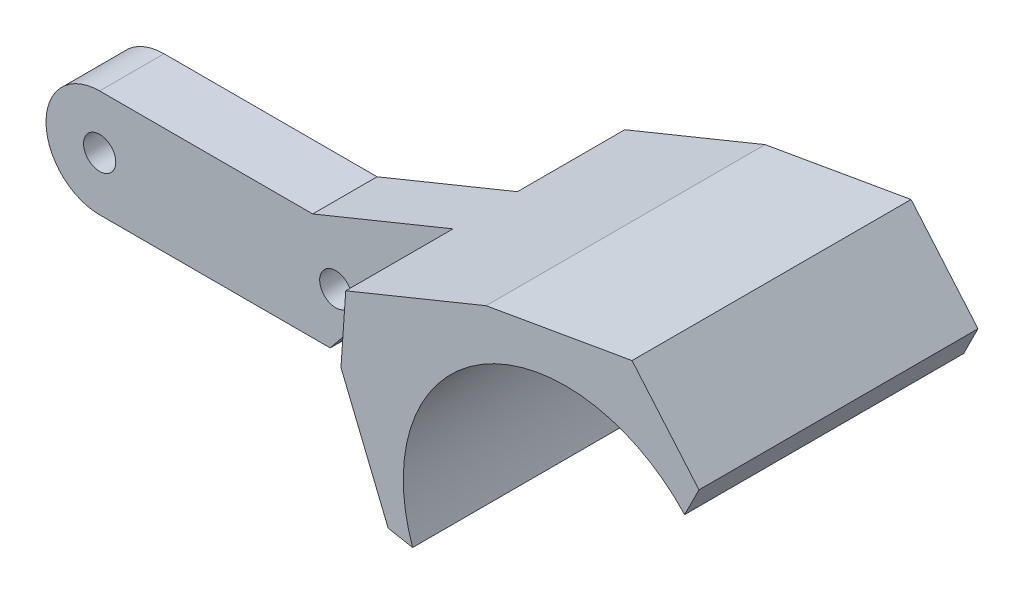
ISO-10303-21;
HEADER;
FILE_DESCRIPTION(('STEP AP214'),'2;1');
FILE_NAME('part.step','',(''),(''),'','','');
FILE_SCHEMA(('AUTOMOTIVE_DESIGN { 1 0 10303 214 1 1 1 1 }'));
ENDSEC;
DATA;
#1=APPLICATION_CONTEXT('core data for automotive mechanical design processes');
#2=APPLICATION_PROTOCOL_DEFINITION('international standard','automotive_design',2000,#1);
#3=PRODUCT_CONTEXT('',#1,'mechanical');
#4=PRODUCT('Part','Part','',(#3));
#5=PRODUCT_RELATED_PRODUCT_CATEGORY('part','',(#4));
#6=PRODUCT_DEFINITION_FORMATION('','',#4);
#7=PRODUCT_DEFINITION_CONTEXT('part definition',#1,'design');
#8=PRODUCT_DEFINITION('design','',#6,#7);
#9=PRODUCT_DEFINITION_SHAPE('','',#8);
#10=(LENGTH_UNIT() NAMED_UNIT(*) SI_UNIT(.MILLI.,.METRE.));
#11=(NAMED_UNIT(*) PLANE_ANGLE_UNIT() SI_UNIT($,.RADIAN.));
#12=(NAMED_UNIT(*) SI_UNIT($,.STERADIAN.) SOLID_ANGLE_UNIT());
#13=UNCERTAINTY_MEASURE_WITH_UNIT(LENGTH_MEASURE(1.E-05),#10,'distance_accuracy_value','');
#14=(GEOMETRIC_REPRESENTATION_CONTEXT(3) GLOBAL_UNCERTAINTY_ASSIGNED_CONTEXT((#13)) GLOBAL_UNIT_ASSIGNED_CONTEXT((#10,
#11,#12)) REPRESENTATION_CONTEXT('',''));
#15=CARTESIAN_POINT('',(0.,0.,0.));
#16=DIRECTION('',(0.,0.,1.));
#17=DIRECTION('',(1.,0.,0.));
#18=AXIS2_PLACEMENT_3D('',#15,#16,#17);
#19=CARTESIAN_POINT('',(-13.5877693584169,0.,9.));
#20=DIRECTION('',(0.,0.,1.));
#21=DIRECTION('',(1.,0.,0.));
#22=AXIS2_PLACEMENT_3D('',#19,#20,#21);
#23=PLANE('',#22);
#24=DIRECTION('',(-0.0692999394417523,-0.997595869274412,0.));
#25=VECTOR('',#24,1.);
#26=CARTESIAN_POINT('',(18.4699286145007,-2.22695040806557,9.));
#27=LINE('',#26,#25);
#28=CARTESIAN_POINT('',(19.3426661423996,10.3363989946344,9.));
#29=VERTEX_POINT('',#28);
#30=CARTESIAN_POINT('',(18.8975900089992,3.92937878986169,9.));
#31=VERTEX_POINT('',#30);
#32=EDGE_CURVE('E58',#29,#31,#27,.T.);
#33=ORIENTED_EDGE('',*,*,#32,.F.);
#34=DIRECTION('',(-0.925886158033167,-0.377802623551745,0.));
#35=VECTOR('',#34,1.);
#36=CARTESIAN_POINT('',(6.26467870963807,5.,9.));
#37=LINE('',#36,#35);
#38=CARTESIAN_POINT('',(6.26467870963807,5.,9.));
#39=VERTEX_POINT('',#38);
#40=EDGE_CURVE('E128',#29,#39,#37,.T.);
#41=ORIENTED_EDGE('',*,*,#40,.T.);
#42=DIRECTION('',(-1.,0.,0.));
#43=VECTOR('',#42,1.);
#44=CARTESIAN_POINT('',(-13.5877693584169,5.,9.));
#45=LINE('',#44,#43);
#46=CARTESIAN_POINT('',(-13.5877693584169,5.,9.));
#47=VERTEX_POINT('',#46);
#48=EDGE_CURVE('E65',#39,#47,#45,.T.);
#49=ORIENTED_EDGE('',*,*,#48,.T.);
#50=CARTESIAN_POINT('',(-13.5877693584169,0.,9.));
#51=DIRECTION('',(0.,0.,1.));
#52=DIRECTION('',(1.,0.,0.));
#53=AXIS2_PLACEMENT_3D('',#50,#51,#52);
#54=CIRCLE('',#53,5.);
#55=CARTESIAN_POINT('',(-13.5877693584169,-5.,9.));
#56=VERTEX_POINT('',#55);
#57=EDGE_CURVE('E147',#47,#56,#54,.T.);
#58=ORIENTED_EDGE('',*,*,#57,.T.);
#59=DIRECTION('',(1.,0.,0.));
#60=VECTOR('',#59,1.);
#61=CARTESIAN_POINT('',(-13.5877693584169,-5.,9.));
#62=LINE('',#61,#60);
#63=CARTESIAN_POINT('',(7.89764564460259,-5.,9.));
#64=VERTEX_POINT('',#63);
#65=EDGE_CURVE('E100',#56,#64,#62,.T.);
#66=ORIENTED_EDGE('',*,*,#65,.T.);
#67=DIRECTION('',(0.624567450076719,0.780970870330427,0.));
#68=VECTOR('',#67,1.);
#69=CARTESIAN_POINT('',(7.89764564460259,-5.,9.));
#70=LINE('',#69,#68);
#71=CARTESIAN_POINT('',(13.1673407024615,1.58932567684477,9.));
#72=VERTEX_POINT('',#71);
#73=EDGE_CURVE('E106',#64,#72,#70,.T.);
#74=ORIENTED_EDGE('',*,*,#73,.T.);
#75=DIRECTION('',(0.925781163628902,0.378059832658689,0.));
#76=VECTOR('',#75,1.);
#77=CARTESIAN_POINT('',(13.1673407024615,1.58932567684477,9.));
#78=LINE('',#77,#76);
#79=EDGE_CURVE('E111',#72,#31,#78,.T.);
#80=ORIENTED_EDGE('',*,*,#79,.T.);
#81=EDGE_LOOP('',(#33,#41,#49,#58,#66,#74,#80));
#82=FACE_BOUND('',#81,.T.);
#83=CARTESIAN_POINT('',(-13.5877693584169,0.,9.));
#84=DIRECTION('',(0.,0.,1.));
#85=DIRECTION('',(1.,0.,0.));
#86=AXIS2_PLACEMENT_3D('',#83,#84,#85);
#87=CIRCLE('',#86,1.5);
#88=CARTESIAN_POINT('',(-12.0877693584169,0.,9.));
#89=VERTEX_POINT('',#88);
#90=EDGE_CURVE('E139',#89,#89,#87,.T.);
#91=ORIENTED_EDGE('',*,*,#90,.F.);
#92=EDGE_LOOP('',(#91));
#93=FACE_BOUND('',#92,.T.);
#94=CARTESIAN_POINT('',(8.41223064158309,0.,9.));
#95=DIRECTION('',(0.,0.,1.));
#96=DIRECTION('',(1.,0.,0.));
#97=AXIS2_PLACEMENT_3D('',#94,#95,#96);
#98=CIRCLE('',#97,1.5);
#99=CARTESIAN_POINT('',(9.91223064158309,0.,9.));
#100=VERTEX_POINT('',#99);
#101=EDGE_CURVE('E208',#100,#100,#98,.T.);
#102=ORIENTED_EDGE('',*,*,#101,.F.);
#103=EDGE_LOOP('',(#102));
#104=FACE_BOUND('',#103,.T.);
#105=ADVANCED_FACE('F43',(#82,#93,#104),#23,.T.);
#106=CARTESIAN_POINT('',(-13.5877693584169,0.,3.));
#107=DIRECTION('',(0.,0.,1.));
#108=DIRECTION('',(1.,0.,0.));
#109=AXIS2_PLACEMENT_3D('',#106,#107,#108);
#110=PLANE('',#109);
#111=DIRECTION('',(-0.925886158033167,-0.377802623551745,0.));
#112=VECTOR('',#111,1.);
#113=CARTESIAN_POINT('',(6.26467870963807,5.,3.));
#114=LINE('',#113,#112);
#115=CARTESIAN_POINT('',(19.3426661423996,10.3363989946344,3.));
#116=VERTEX_POINT('',#115);
#117=CARTESIAN_POINT('',(6.26467870963807,5.,3.));
#118=VERTEX_POINT('',#117);
#119=EDGE_CURVE('E144',#116,#118,#114,.T.);
#120=ORIENTED_EDGE('',*,*,#119,.F.);
#121=DIRECTION('',(-0.0692999394417523,-0.997595869274412,0.));
#122=VECTOR('',#121,1.);
#123=CARTESIAN_POINT('',(18.4699286145007,-2.22695040806557,3.));
#124=LINE('',#123,#122);
#125=CARTESIAN_POINT('',(18.8975900089992,3.92937878986169,3.));
#126=VERTEX_POINT('',#125);
#127=EDGE_CURVE('E176',#116,#126,#124,.T.);
#128=ORIENTED_EDGE('',*,*,#127,.T.);
#129=DIRECTION('',(0.925781163628902,0.378059832658689,0.));
#130=VECTOR('',#129,1.);
#131=CARTESIAN_POINT('',(13.1673407024615,1.58932567684477,3.));
#132=LINE('',#131,#130);
#133=CARTESIAN_POINT('',(13.1673407024615,1.58932567684477,3.));
#134=VERTEX_POINT('',#133);
#135=EDGE_CURVE('E142',#134,#126,#132,.T.);
#136=ORIENTED_EDGE('',*,*,#135,.F.);
#137=DIRECTION('',(0.624567450076719,0.780970870330427,0.));
#138=VECTOR('',#137,1.);
#139=CARTESIAN_POINT('',(7.89764564460259,-5.,3.));
#140=LINE('',#139,#138);
#141=CARTESIAN_POINT('',(7.89764564460259,-5.,3.));
#142=VERTEX_POINT('',#141);
#143=EDGE_CURVE('E119',#142,#134,#140,.T.);
#144=ORIENTED_EDGE('',*,*,#143,.F.);
#145=DIRECTION('',(1.,0.,0.));
#146=VECTOR('',#145,1.);
#147=CARTESIAN_POINT('',(-13.5877693584169,-5.,3.));
#148=LINE('',#147,#146);
#149=CARTESIAN_POINT('',(-13.5877693584169,-5.,3.));
#150=VERTEX_POINT('',#149);
#151=EDGE_CURVE('E138',#150,#142,#148,.T.);
#152=ORIENTED_EDGE('',*,*,#151,.F.);
#153=CARTESIAN_POINT('',(-13.5877693584169,0.,3.));
#154=DIRECTION('',(0.,0.,1.));
#155=DIRECTION('',(1.,0.,0.));
#156=AXIS2_PLACEMENT_3D('',#153,#154,#155);
#157=CIRCLE('',#156,5.);
#158=CARTESIAN_POINT('',(-13.5877693584169,5.,3.));
#159=VERTEX_POINT('',#158);
#160=EDGE_CURVE('E135',#159,#150,#157,.T.);
#161=ORIENTED_EDGE('',*,*,#160,.F.);
#162=DIRECTION('',(-1.,0.,0.));
#163=VECTOR('',#162,1.);
#164=CARTESIAN_POINT('',(-13.5877693584169,5.,3.));
#165=LINE('',#164,#163);
#166=EDGE_CURVE('E92',#118,#159,#165,.T.);
#167=ORIENTED_EDGE('',*,*,#166,.F.);
#168=EDGE_LOOP('',(#120,#128,#136,#144,#152,#161,#167));
#169=FACE_BOUND('',#168,.T.);
#170=CARTESIAN_POINT('',(-13.5877693584169,0.,3.));
#171=DIRECTION('',(0.,0.,1.));
#172=DIRECTION('',(1.,0.,0.));
#173=AXIS2_PLACEMENT_3D('',#170,#171,#172);
#174=CIRCLE('',#173,1.5);
#175=CARTESIAN_POINT('',(-12.0877693584169,0.,3.));
#176=VERTEX_POINT('',#175);
#177=EDGE_CURVE('E211',#176,#176,#174,.T.);
#178=ORIENTED_EDGE('',*,*,#177,.T.);
#179=EDGE_LOOP('',(#178));
#180=FACE_BOUND('',#179,.T.);
#181=CARTESIAN_POINT('',(8.41223064158309,0.,3.));
#182=DIRECTION('',(0.,0.,1.));
#183=DIRECTION('',(1.,0.,0.));
#184=AXIS2_PLACEMENT_3D('',#181,#182,#183);
#185=CIRCLE('',#184,1.5);
#186=CARTESIAN_POINT('',(9.91223064158309,0.,3.));
#187=VERTEX_POINT('',#186);
#188=EDGE_CURVE('E207',#187,#187,#185,.T.);
#189=ORIENTED_EDGE('',*,*,#188,.T.);
#190=EDGE_LOOP('',(#189));
#191=FACE_BOUND('',#190,.T.);
#192=ADVANCED_FACE('F171',(#169,#180,#191),#110,.F.);
#193=CARTESIAN_POINT('',(-13.5877693584169,0.,9.));
#194=DIRECTION('',(0.,0.,-1.));
#195=DIRECTION('',(-1.,0.,0.));
#196=AXIS2_PLACEMENT_3D('',#193,#194,#195);
#197=CYLINDRICAL_SURFACE('',#196,5.);
#198=ORIENTED_EDGE('',*,*,#160,.T.);
#199=DIRECTION('',(0.,0.,-1.));
#200=VECTOR('',#199,1.);
#201=CARTESIAN_POINT('',(-13.5877693584169,-5.,9.));
#202=LINE('',#201,#200);
#203=EDGE_CURVE('E11',#56,#150,#202,.T.);
#204=ORIENTED_EDGE('',*,*,#203,.F.);
#205=ORIENTED_EDGE('',*,*,#57,.F.);
#206=DIRECTION('',(0.,0.,-1.));
#207=VECTOR('',#206,1.);
#208=CARTESIAN_POINT('',(-13.5877693584169,5.,9.));
#209=LINE('',#208,#207);
#210=EDGE_CURVE('E134',#47,#159,#209,.T.);
#211=ORIENTED_EDGE('',*,*,#210,.T.);
#212=EDGE_LOOP('',(#198,#204,#205,#211));
#213=FACE_BOUND('',#212,.T.);
#214=ADVANCED_FACE('F45',(#213),#197,.T.);
#215=CARTESIAN_POINT('',(-13.5877693584169,-5.,9.));
#216=DIRECTION('',(0.,1.,0.));
#217=DIRECTION('',(-1.,0.,0.));
#218=AXIS2_PLACEMENT_3D('',#215,#216,#217);
#219=PLANE('',#218);
#220=ORIENTED_EDGE('',*,*,#151,.T.);
#221=DIRECTION('',(0.,0.,-1.));
#222=VECTOR('',#221,1.);
#223=CARTESIAN_POINT('',(7.89764564460259,-5.,9.));
#224=LINE('',#223,#222);
#225=EDGE_CURVE('E51',#64,#142,#224,.T.);
#226=ORIENTED_EDGE('',*,*,#225,.F.);
#227=ORIENTED_EDGE('',*,*,#65,.F.);
#228=ORIENTED_EDGE('',*,*,#203,.T.);
#229=EDGE_LOOP('',(#220,#226,#227,#228));
#230=FACE_BOUND('',#229,.T.);
#231=ADVANCED_FACE('F221',(#230),#219,.F.);
#232=CARTESIAN_POINT('',(7.89764564460259,-5.,9.));
#233=DIRECTION('',(-0.780970870330427,0.624567450076719,0.));
#234=DIRECTION('',(-0.624567450076719,-0.780970870330428,0.));
#235=AXIS2_PLACEMENT_3D('',#232,#233,#234);
#236=PLANE('',#235);
#237=ORIENTED_EDGE('',*,*,#143,.T.);
#238=DIRECTION('',(0.,0.,-1.));
#239=VECTOR('',#238,1.);
#240=CARTESIAN_POINT('',(13.1673407024615,1.58932567684477,9.));
#241=LINE('',#240,#239);
#242=EDGE_CURVE('E116',#72,#134,#241,.T.);
#243=ORIENTED_EDGE('',*,*,#242,.F.);
#244=ORIENTED_EDGE('',*,*,#73,.F.);
#245=ORIENTED_EDGE('',*,*,#225,.T.);
#246=EDGE_LOOP('',(#237,#243,#244,#245));
#247=FACE_BOUND('',#246,.T.);
#248=ADVANCED_FACE('F117',(#247),#236,.F.);
#249=CARTESIAN_POINT('',(13.1673407024615,1.58932567684477,9.));
#250=DIRECTION('',(-0.378059832658689,0.925781163628902,0.));
#251=DIRECTION('',(-0.925781163628902,-0.378059832658689,0.));
#252=AXIS2_PLACEMENT_3D('',#249,#250,#251);
#253=PLANE('',#252);
#254=ORIENTED_EDGE('',*,*,#135,.T.);
#255=DIRECTION('',(0.,0.,-1.));
#256=VECTOR('',#255,1.);
#257=CARTESIAN_POINT('',(18.8975900089992,3.92937878986169,9.));
#258=LINE('',#257,#256);
#259=EDGE_CURVE('E123',#31,#126,#258,.T.);
#260=ORIENTED_EDGE('',*,*,#259,.F.);
#261=ORIENTED_EDGE('',*,*,#79,.F.);
#262=ORIENTED_EDGE('',*,*,#242,.T.);
#263=EDGE_LOOP('',(#254,#260,#261,#262));
#264=FACE_BOUND('',#263,.T.);
#265=ADVANCED_FACE('F126',(#264),#253,.F.);
#266=CARTESIAN_POINT('',(23.2965282034834,-6.84260428960336,9.));
#267=DIRECTION('',(0.925781163629019,0.378059832658403,0.));
#268=DIRECTION('',(-0.378059832658403,0.925781163629019,0.));
#269=AXIS2_PLACEMENT_3D('',#266,#267,#268);
#270=PLANE('',#269);
#271=ORIENTED_EDGE('',*,*,#259,.T.);
#272=DIRECTION('',(0.,0.,1.));
#273=VECTOR('',#272,1.);
#274=CARTESIAN_POINT('',(18.8975900089992,3.92937878986169,-7.));
#275=LINE('',#274,#273);
#276=CARTESIAN_POINT('',(18.8975900089992,3.92937878986169,-7.));
#277=VERTEX_POINT('',#276);
#278=EDGE_CURVE('E183',#277,#126,#275,.T.);
#279=ORIENTED_EDGE('',*,*,#278,.F.);
#280=DIRECTION('',(0.378059832658403,-0.925781163629019,0.));
#281=VECTOR('',#280,1.);
#282=CARTESIAN_POINT('',(18.8975900089992,3.92937878986169,-7.));
#283=LINE('',#282,#281);
#284=CARTESIAN_POINT('',(23.2965282034834,-6.84260428960336,-7.));
#285=VERTEX_POINT('',#284);
#286=EDGE_CURVE('E458',#277,#285,#283,.T.);
#287=ORIENTED_EDGE('',*,*,#286,.T.);
#288=DIRECTION('',(0.,0.,-1.));
#289=VECTOR('',#288,1.);
#290=CARTESIAN_POINT('',(23.2965282034834,-6.84260428960336,9.));
#291=LINE('',#290,#289);
#292=CARTESIAN_POINT('',(23.2965282034834,-6.84260428960336,19.));
#293=VERTEX_POINT('',#292);
#294=EDGE_CURVE('E166',#293,#285,#291,.T.);
#295=ORIENTED_EDGE('',*,*,#294,.F.);
#296=DIRECTION('',(0.378059832658403,-0.925781163629019,0.));
#297=VECTOR('',#296,1.);
#298=CARTESIAN_POINT('',(18.8975900089992,3.92937878986169,19.));
#299=LINE('',#298,#297);
#300=CARTESIAN_POINT('',(18.8975900089992,3.92937878986169,19.));
#301=VERTEX_POINT('',#300);
#302=EDGE_CURVE('E191',#301,#293,#299,.T.);
#303=ORIENTED_EDGE('',*,*,#302,.F.);
#304=EDGE_CURVE('E187',#31,#301,#275,.T.);
#305=ORIENTED_EDGE('',*,*,#304,.F.);
#306=EDGE_LOOP('',(#271,#279,#287,#295,#303,#305));
#307=FACE_BOUND('',#306,.T.);
#308=ADVANCED_FACE('F180',(#307),#270,.F.);
#309=CARTESIAN_POINT('',(23.2965282034834,-6.84260428960336,9.));
#310=DIRECTION('',(0.182403137016179,0.983223827826938,0.));
#311=DIRECTION('',(-0.983223827826939,0.182403137016179,0.));
#312=AXIS2_PLACEMENT_3D('',#309,#310,#311);
#313=PLANE('',#312);
#314=ORIENTED_EDGE('',*,*,#294,.T.);
#315=DIRECTION('',(0.983223827826933,-0.182403137016207,0.));
#316=VECTOR('',#315,1.);
#317=CARTESIAN_POINT('',(23.2965282034834,-6.84260428960336,-7.));
#318=LINE('',#317,#316);
#319=CARTESIAN_POINT('',(25.5770058268283,-7.26566795081742,-7.));
#320=VERTEX_POINT('',#319);
#321=EDGE_CURVE('E460',#285,#320,#318,.T.);
#322=ORIENTED_EDGE('',*,*,#321,.T.);
#323=DIRECTION('',(0.,0.,-1.));
#324=VECTOR('',#323,1.);
#325=CARTESIAN_POINT('',(25.5770058268283,-7.26566795081742,9.));
#326=LINE('',#325,#324);
#327=CARTESIAN_POINT('',(25.5770058268283,-7.26566795081742,19.));
#328=VERTEX_POINT('',#327);
#329=EDGE_CURVE('E163',#328,#320,#326,.T.);
#330=ORIENTED_EDGE('',*,*,#329,.F.);
#331=DIRECTION('',(0.983223827826933,-0.182403137016207,0.));
#332=VECTOR('',#331,1.);
#333=CARTESIAN_POINT('',(23.2965282034834,-6.84260428960336,19.));
#334=LINE('',#333,#332);
#335=EDGE_CURVE('E440',#293,#328,#334,.T.);
#336=ORIENTED_EDGE('',*,*,#335,.F.);
#337=EDGE_LOOP('',(#314,#322,#330,#336));
#338=FACE_BOUND('',#337,.T.);
#339=ADVANCED_FACE('F260',(#338),#313,.F.);
#340=CARTESIAN_POINT('',(39.823422944903,-2.20547841092328,9.));
#341=DIRECTION('',(0.,0.,-1.));
#342=DIRECTION('',(-1.,0.,0.));
#343=AXIS2_PLACEMENT_3D('',#340,#341,#342);
#344=CYLINDRICAL_SURFACE('',#343,15.1183967034149);
#345=ORIENTED_EDGE('',*,*,#329,.T.);
#346=CARTESIAN_POINT('',(39.8234229449031,-2.20547841092323,-7.));
#347=DIRECTION('',(0.,0.,-1.));
#348=DIRECTION('',(1.,0.,0.));
#349=AXIS2_PLACEMENT_3D('',#346,#347,#348);
#350=CIRCLE('',#349,15.118396703415);
#351=CARTESIAN_POINT('',(50.9211745382782,8.06125565856399,-7.));
#352=VERTEX_POINT('',#351);
#353=EDGE_CURVE('E463',#320,#352,#350,.T.);
#354=ORIENTED_EDGE('',*,*,#353,.T.);
#355=DIRECTION('',(0.,0.,-1.));
#356=VECTOR('',#355,1.);
#357=CARTESIAN_POINT('',(50.9211745382782,8.06125565856399,9.));
#358=LINE('',#357,#356);
#359=CARTESIAN_POINT('',(50.9211745382782,8.06125565856399,19.));
#360=VERTEX_POINT('',#359);
#361=EDGE_CURVE('E160',#360,#352,#358,.T.);
#362=ORIENTED_EDGE('',*,*,#361,.F.);
#363=CARTESIAN_POINT('',(39.8234229449031,-2.20547841092323,19.));
#364=DIRECTION('',(0.,0.,-1.));
#365=DIRECTION('',(1.,0.,0.));
#366=AXIS2_PLACEMENT_3D('',#363,#364,#365);
#367=CIRCLE('',#366,15.118396703415);
#368=EDGE_CURVE('E443',#328,#360,#367,.T.);
#369=ORIENTED_EDGE('',*,*,#368,.F.);
#370=EDGE_LOOP('',(#345,#354,#362,#369));
#371=FACE_BOUND('',#370,.T.);
#372=ADVANCED_FACE('F256',(#371),#344,.F.);
#373=CARTESIAN_POINT('',(52.2585760854705,10.7312425184029,9.));
#374=DIRECTION('',(-0.894104393722815,0.447858608408455,0.));
#375=DIRECTION('',(-0.447858608408455,-0.894104393722815,0.));
#376=AXIS2_PLACEMENT_3D('',#373,#374,#375);
#377=PLANE('',#376);
#378=ORIENTED_EDGE('',*,*,#361,.T.);
#379=DIRECTION('',(0.447858608408455,0.894104393722815,0.));
#380=VECTOR('',#379,1.);
#381=CARTESIAN_POINT('',(52.2585760854705,10.7312425184029,-7.));
#382=LINE('',#381,#380);
#383=CARTESIAN_POINT('',(52.2585760854705,10.7312425184029,-7.));
#384=VERTEX_POINT('',#383);
#385=EDGE_CURVE('E466',#352,#384,#382,.T.);
#386=ORIENTED_EDGE('',*,*,#385,.T.);
#387=DIRECTION('',(0.,0.,-1.));
#388=VECTOR('',#387,1.);
#389=CARTESIAN_POINT('',(52.2585760854705,10.7312425184029,9.));
#390=LINE('',#389,#388);
#391=CARTESIAN_POINT('',(52.2585760854705,10.7312425184029,19.));
#392=VERTEX_POINT('',#391);
#393=EDGE_CURVE('E157',#392,#384,#390,.T.);
#394=ORIENTED_EDGE('',*,*,#393,.F.);
#395=DIRECTION('',(0.447858608408455,0.894104393722815,0.));
#396=VECTOR('',#395,1.);
#397=CARTESIAN_POINT('',(52.2585760854705,10.7312425184029,19.));
#398=LINE('',#397,#396);
#399=EDGE_CURVE('E446',#360,#392,#398,.T.);
#400=ORIENTED_EDGE('',*,*,#399,.F.);
#401=EDGE_LOOP('',(#378,#386,#394,#400));
#402=FACE_BOUND('',#401,.T.);
#403=ADVANCED_FACE('F252',(#402),#377,.F.);
#404=CARTESIAN_POINT('',(46.0217371683997,18.0462429690747,9.));
#405=DIRECTION('',(-0.760958552063964,-0.648800494790745,0.));
#406=DIRECTION('',(0.648800494790745,-0.760958552063964,0.));
#407=AXIS2_PLACEMENT_3D('',#404,#405,#406);
#408=PLANE('',#407);
#409=ORIENTED_EDGE('',*,*,#393,.T.);
#410=DIRECTION('',(-0.648800494790745,0.760958552063964,0.));
#411=VECTOR('',#410,1.);
#412=CARTESIAN_POINT('',(46.0217371683997,18.0462429690747,-7.));
#413=LINE('',#412,#411);
#414=CARTESIAN_POINT('',(46.0217371683997,18.0462429690747,-7.));
#415=VERTEX_POINT('',#414);
#416=EDGE_CURVE('E468',#384,#415,#413,.T.);
#417=ORIENTED_EDGE('',*,*,#416,.T.);
#418=DIRECTION('',(0.,0.,-1.));
#419=VECTOR('',#418,1.);
#420=CARTESIAN_POINT('',(46.0217371683997,18.0462429690747,9.));
#421=LINE('',#420,#419);
#422=CARTESIAN_POINT('',(46.0217371683997,18.0462429690747,19.));
#423=VERTEX_POINT('',#422);
#424=EDGE_CURVE('E154',#423,#415,#421,.T.);
#425=ORIENTED_EDGE('',*,*,#424,.F.);
#426=DIRECTION('',(-0.648800494790745,0.760958552063964,0.));
#427=VECTOR('',#426,1.);
#428=CARTESIAN_POINT('',(46.0217371683997,18.0462429690747,19.));
#429=LINE('',#428,#427);
#430=EDGE_CURVE('E449',#392,#423,#429,.T.);
#431=ORIENTED_EDGE('',*,*,#430,.F.);
#432=EDGE_LOOP('',(#409,#417,#425,#431));
#433=FACE_BOUND('',#432,.T.);
#434=ADVANCED_FACE('F248',(#433),#408,.F.);
#435=CARTESIAN_POINT('',(32.4206535751611,15.6727979892687,9.));
#436=DIRECTION('',(0.171906319420854,-0.985113301779636,0.));
#437=DIRECTION('',(0.985113301779636,0.171906319420854,0.));
#438=AXIS2_PLACEMENT_3D('',#435,#436,#437);
#439=PLANE('',#438);
#440=ORIENTED_EDGE('',*,*,#424,.T.);
#441=DIRECTION('',(-0.985113301779635,-0.171906319420854,0.));
#442=VECTOR('',#441,1.);
#443=CARTESIAN_POINT('',(32.4206535751611,15.6727979892687,-7.));
#444=LINE('',#443,#442);
#445=CARTESIAN_POINT('',(32.4206535751611,15.6727979892687,-7.));
#446=VERTEX_POINT('',#445);
#447=EDGE_CURVE('E202',#415,#446,#444,.T.);
#448=ORIENTED_EDGE('',*,*,#447,.T.);
#449=DIRECTION('',(0.,0.,-1.));
#450=VECTOR('',#449,1.);
#451=CARTESIAN_POINT('',(32.4206535751611,15.6727979892687,9.));
#452=LINE('',#451,#450);
#453=CARTESIAN_POINT('',(32.4206535751611,15.6727979892687,19.));
#454=VERTEX_POINT('',#453);
#455=EDGE_CURVE('E151',#454,#446,#452,.T.);
#456=ORIENTED_EDGE('',*,*,#455,.F.);
#457=DIRECTION('',(-0.985113301779635,-0.171906319420854,0.));
#458=VECTOR('',#457,1.);
#459=CARTESIAN_POINT('',(32.4206535751611,15.6727979892687,19.));
#460=LINE('',#459,#458);
#461=EDGE_CURVE('E433',#423,#454,#460,.T.);
#462=ORIENTED_EDGE('',*,*,#461,.F.);
#463=EDGE_LOOP('',(#440,#448,#456,#462));
#464=FACE_BOUND('',#463,.T.);
#465=ADVANCED_FACE('F244',(#464),#439,.F.);
#466=CARTESIAN_POINT('',(6.26467870963807,5.,9.));
#467=DIRECTION('',(0.377802623551745,-0.925886158033167,0.));
#468=DIRECTION('',(0.925886158033167,0.377802623551745,0.));
#469=AXIS2_PLACEMENT_3D('',#466,#467,#468);
#470=PLANE('',#469);
#471=ORIENTED_EDGE('',*,*,#40,.F.);
#472=DIRECTION('',(0.,0.,1.));
#473=VECTOR('',#472,1.);
#474=CARTESIAN_POINT('',(19.3426661423996,10.3363989946344,-7.));
#475=LINE('',#474,#473);
#476=CARTESIAN_POINT('',(19.3426661423996,10.3363989946344,19.));
#477=VERTEX_POINT('',#476);
#478=EDGE_CURVE('E199',#29,#477,#475,.T.);
#479=ORIENTED_EDGE('',*,*,#478,.T.);
#480=DIRECTION('',(-0.925886158033167,-0.377802623551745,0.));
#481=VECTOR('',#480,1.);
#482=CARTESIAN_POINT('',(19.3426661423996,10.3363989946344,19.));
#483=LINE('',#482,#481);
#484=EDGE_CURVE('E428',#454,#477,#483,.T.);
#485=ORIENTED_EDGE('',*,*,#484,.F.);
#486=ORIENTED_EDGE('',*,*,#455,.T.);
#487=DIRECTION('',(-0.925886158033167,-0.377802623551745,0.));
#488=VECTOR('',#487,1.);
#489=CARTESIAN_POINT('',(19.3426661423996,10.3363989946344,-7.));
#490=LINE('',#489,#488);
#491=CARTESIAN_POINT('',(19.3426661423996,10.3363989946344,-7.));
#492=VERTEX_POINT('',#491);
#493=EDGE_CURVE('E452',#446,#492,#490,.T.);
#494=ORIENTED_EDGE('',*,*,#493,.T.);
#495=EDGE_CURVE('E196',#492,#116,#475,.T.);
#496=ORIENTED_EDGE('',*,*,#495,.T.);
#497=ORIENTED_EDGE('',*,*,#119,.T.);
#498=DIRECTION('',(0.,0.,-1.));
#499=VECTOR('',#498,1.);
#500=CARTESIAN_POINT('',(6.26467870963807,5.,9.));
#501=LINE('',#500,#499);
#502=EDGE_CURVE('E149',#39,#118,#501,.T.);
#503=ORIENTED_EDGE('',*,*,#502,.F.);
#504=EDGE_LOOP('',(#471,#479,#485,#486,#494,#496,#497,#503));
#505=FACE_BOUND('',#504,.T.);
#506=ADVANCED_FACE('F241',(#505),#470,.F.);
#507=CARTESIAN_POINT('',(-13.5877693584169,5.,9.));
#508=DIRECTION('',(0.,-1.,0.));
#509=DIRECTION('',(0.,0.,-1.));
#510=AXIS2_PLACEMENT_3D('',#507,#508,#509);
#511=PLANE('',#510);
#512=ORIENTED_EDGE('',*,*,#166,.T.);
#513=ORIENTED_EDGE('',*,*,#210,.F.);
#514=ORIENTED_EDGE('',*,*,#48,.F.);
#515=ORIENTED_EDGE('',*,*,#502,.T.);
#516=EDGE_LOOP('',(#512,#513,#514,#515));
#517=FACE_BOUND('',#516,.T.);
#518=ADVANCED_FACE('F238',(#517),#511,.F.);
#519=CARTESIAN_POINT('',(-13.5877693584169,0.,9.));
#520=DIRECTION('',(0.,0.,-1.));
#521=DIRECTION('',(-1.,0.,0.));
#522=AXIS2_PLACEMENT_3D('',#519,#520,#521);
#523=CYLINDRICAL_SURFACE('',#522,1.5);
#524=ORIENTED_EDGE('',*,*,#90,.T.);
#525=EDGE_LOOP('',(#524));
#526=FACE_BOUND('',#525,.T.);
#527=ORIENTED_EDGE('',*,*,#177,.F.);
#528=EDGE_LOOP('',(#527));
#529=FACE_BOUND('',#528,.T.);
#530=ADVANCED_FACE('F235',(#526,#529),#523,.F.);
#531=CARTESIAN_POINT('',(8.41223064158309,0.,9.));
#532=DIRECTION('',(0.,0.,-1.));
#533=DIRECTION('',(-1.,0.,0.));
#534=AXIS2_PLACEMENT_3D('',#531,#532,#533);
#535=CYLINDRICAL_SURFACE('',#534,1.5);
#536=ORIENTED_EDGE('',*,*,#101,.T.);
#537=EDGE_LOOP('',(#536));
#538=FACE_BOUND('',#537,.T.);
#539=ORIENTED_EDGE('',*,*,#188,.F.);
#540=EDGE_LOOP('',(#539));
#541=FACE_BOUND('',#540,.T.);
#542=ADVANCED_FACE('F312',(#538,#541),#535,.F.);
#543=CARTESIAN_POINT('',(39.8234229449031,-2.20547841092323,-7.));
#544=DIRECTION('',(0.,0.,1.));
#545=DIRECTION('',(1.,0.,0.));
#546=AXIS2_PLACEMENT_3D('',#543,#544,#545);
#547=PLANE('',#546);
#548=ORIENTED_EDGE('',*,*,#493,.F.);
#549=ORIENTED_EDGE('',*,*,#447,.F.);
#550=ORIENTED_EDGE('',*,*,#416,.F.);
#551=ORIENTED_EDGE('',*,*,#385,.F.);
#552=ORIENTED_EDGE('',*,*,#353,.F.);
#553=ORIENTED_EDGE('',*,*,#321,.F.);
#554=ORIENTED_EDGE('',*,*,#286,.F.);
#555=DIRECTION('',(-0.0692999394417523,-0.997595869274412,0.));
#556=VECTOR('',#555,1.);
#557=CARTESIAN_POINT('',(19.3426661423996,10.3363989946344,-7.));
#558=LINE('',#557,#556);
#559=EDGE_CURVE('E455',#492,#277,#558,.T.);
#560=ORIENTED_EDGE('',*,*,#559,.F.);
#561=EDGE_LOOP('',(#548,#549,#550,#551,#552,#553,#554,#560));
#562=FACE_BOUND('',#561,.T.);
#563=ADVANCED_FACE('F319',(#562),#547,.F.);
#564=CARTESIAN_POINT('',(19.3426661423996,10.3363989946344,-7.));
#565=DIRECTION('',(-0.997595869274412,0.0692999394417523,0.));
#566=DIRECTION('',(-0.0692999394417523,-0.997595869274412,0.));
#567=AXIS2_PLACEMENT_3D('',#564,#565,#566);
#568=PLANE('',#567);
#569=ORIENTED_EDGE('',*,*,#127,.F.);
#570=ORIENTED_EDGE('',*,*,#495,.F.);
#571=ORIENTED_EDGE('',*,*,#559,.T.);
#572=ORIENTED_EDGE('',*,*,#278,.T.);
#573=EDGE_LOOP('',(#569,#570,#571,#572));
#574=FACE_BOUND('',#573,.T.);
#575=ADVANCED_FACE('F325',(#574),#568,.T.);
#576=ORIENTED_EDGE('',*,*,#478,.F.);
#577=ORIENTED_EDGE('',*,*,#32,.T.);
#578=ORIENTED_EDGE('',*,*,#304,.T.);
#579=DIRECTION('',(-0.0692999394417523,-0.997595869274412,0.));
#580=VECTOR('',#579,1.);
#581=CARTESIAN_POINT('',(19.3426661423996,10.3363989946344,19.));
#582=LINE('',#581,#580);
#583=EDGE_CURVE('E429',#477,#301,#582,.T.);
#584=ORIENTED_EDGE('',*,*,#583,.F.);
#585=EDGE_LOOP('',(#576,#577,#578,#584));
#586=FACE_BOUND('',#585,.T.);
#587=ADVANCED_FACE('F333',(#586),#568,.T.);
#588=CARTESIAN_POINT('',(39.8234229449031,-2.20547841092323,19.));
#589=DIRECTION('',(0.,0.,1.));
#590=DIRECTION('',(1.,0.,0.));
#591=AXIS2_PLACEMENT_3D('',#588,#589,#590);
#592=PLANE('',#591);
#593=ORIENTED_EDGE('',*,*,#484,.T.);
#594=ORIENTED_EDGE('',*,*,#583,.T.);
#595=ORIENTED_EDGE('',*,*,#302,.T.);
#596=ORIENTED_EDGE('',*,*,#335,.T.);
#597=ORIENTED_EDGE('',*,*,#368,.T.);
#598=ORIENTED_EDGE('',*,*,#399,.T.);
#599=ORIENTED_EDGE('',*,*,#430,.T.);
#600=ORIENTED_EDGE('',*,*,#461,.T.);
#601=EDGE_LOOP('',(#593,#594,#595,#596,#597,#598,#599,#600));
#602=FACE_BOUND('',#601,.T.);
#603=ADVANCED_FACE('F341',(#602),#592,.T.);
#604=CLOSED_SHELL('',(#105,#192,#214,#231,#248,#265,#308,#339,#372,#403,#434,#465,#506,#518,
#530,#542,#563,#575,#587,#603));
#605=MANIFOLD_SOLID_BREP('B2',#604);
#606=ADVANCED_BREP_SHAPE_REPRESENTATION('',(#18,#605),#14);
#607=SHAPE_DEFINITION_REPRESENTATION(#9,#606);
ENDSEC;
END-ISO-10303-21;
